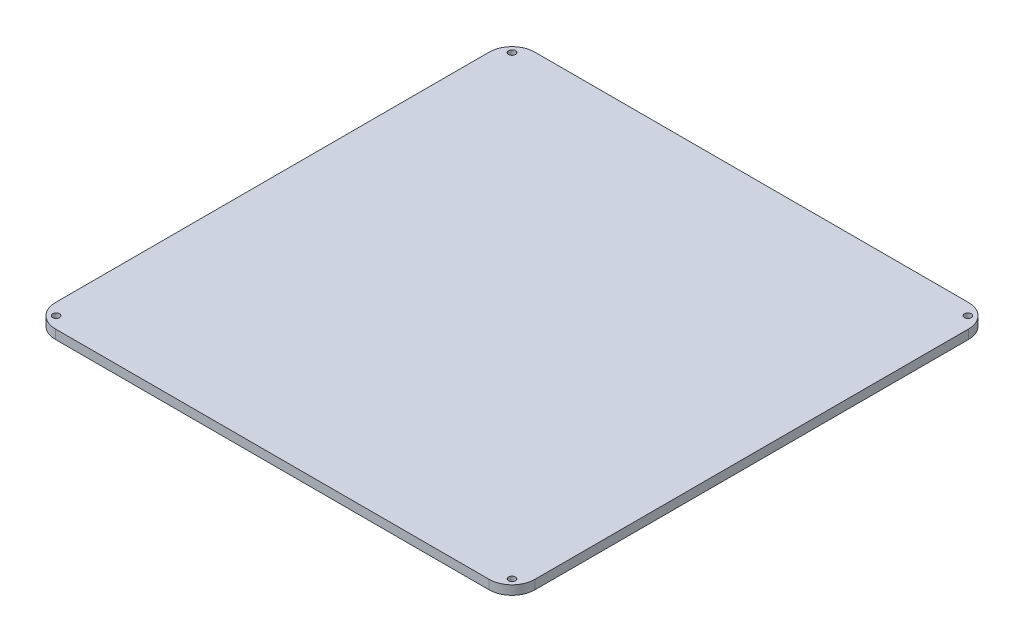
ISO-10303-21;
HEADER;
FILE_DESCRIPTION(('STEP AP214'),'2;1');
FILE_NAME('part.step','',(''),(''),'','','');
FILE_SCHEMA(('AUTOMOTIVE_DESIGN { 1 0 10303 214 1 1 1 1 }'));
ENDSEC;
DATA;
#1=APPLICATION_CONTEXT('core data for automotive mechanical design processes');
#2=APPLICATION_PROTOCOL_DEFINITION('international standard','automotive_design',2000,#1);
#3=PRODUCT_CONTEXT('',#1,'mechanical');
#4=PRODUCT('Part','Part','',(#3));
#5=PRODUCT_RELATED_PRODUCT_CATEGORY('part','',(#4));
#6=PRODUCT_DEFINITION_FORMATION('','',#4);
#7=PRODUCT_DEFINITION_CONTEXT('part definition',#1,'design');
#8=PRODUCT_DEFINITION('design','',#6,#7);
#9=PRODUCT_DEFINITION_SHAPE('','',#8);
#10=(LENGTH_UNIT() NAMED_UNIT(*) SI_UNIT(.MILLI.,.METRE.));
#11=(NAMED_UNIT(*) PLANE_ANGLE_UNIT() SI_UNIT($,.RADIAN.));
#12=(NAMED_UNIT(*) SI_UNIT($,.STERADIAN.) SOLID_ANGLE_UNIT());
#13=UNCERTAINTY_MEASURE_WITH_UNIT(LENGTH_MEASURE(1.E-05),#10,'distance_accuracy_value','');
#14=(GEOMETRIC_REPRESENTATION_CONTEXT(3) GLOBAL_UNCERTAINTY_ASSIGNED_CONTEXT((#13)) GLOBAL_UNIT_ASSIGNED_CONTEXT((#10,
#11,#12)) REPRESENTATION_CONTEXT('',''));
#15=CARTESIAN_POINT('',(0.,0.,0.));
#16=DIRECTION('',(0.,0.,1.));
#17=DIRECTION('',(1.,0.,0.));
#18=AXIS2_PLACEMENT_3D('',#15,#16,#17);
#19=CARTESIAN_POINT('',(0.,4.,0.));
#20=DIRECTION('',(0.,1.,0.));
#21=DIRECTION('',(0.,0.,1.));
#22=AXIS2_PLACEMENT_3D('',#19,#20,#21);
#23=PLANE('',#22);
#24=CARTESIAN_POINT('',(99.8332738110422,4.,99.8332738110422));
#25=DIRECTION('',(0.,1.,0.));
#26=DIRECTION('',(0.,0.,1.));
#27=AXIS2_PLACEMENT_3D('',#24,#25,#26);
#28=CIRCLE('',#27,1.5);
#29=CARTESIAN_POINT('',(99.8332738110422,4.,101.333273811042));
#30=VERTEX_POINT('',#29);
#31=EDGE_CURVE('E232',#30,#30,#28,.T.);
#32=ORIENTED_EDGE('',*,*,#31,.F.);
#33=EDGE_LOOP('',(#32));
#34=FACE_BOUND('',#33,.T.);
#35=CARTESIAN_POINT('',(-99.8332738110422,4.,-99.8332738110422));
#36=DIRECTION('',(0.,1.,0.));
#37=DIRECTION('',(0.,0.,1.));
#38=AXIS2_PLACEMENT_3D('',#35,#36,#37);
#39=CIRCLE('',#38,1.5);
#40=CARTESIAN_POINT('',(-99.8332738110422,4.,-98.3332738110422));
#41=VERTEX_POINT('',#40);
#42=EDGE_CURVE('E244',#41,#41,#39,.T.);
#43=ORIENTED_EDGE('',*,*,#42,.F.);
#44=EDGE_LOOP('',(#43));
#45=FACE_BOUND('',#44,.T.);
#46=DIRECTION('',(1.,0.,0.));
#47=VECTOR('',#46,1.);
#48=CARTESIAN_POINT('',(-105.,4.,-105.));
#49=LINE('',#48,#47);
#50=CARTESIAN_POINT('',(-95.,4.,-105.));
#51=VERTEX_POINT('',#50);
#52=CARTESIAN_POINT('',(95.,4.,-105.));
#53=VERTEX_POINT('',#52);
#54=EDGE_CURVE('E133',#51,#53,#49,.T.);
#55=ORIENTED_EDGE('',*,*,#54,.F.);
#56=CARTESIAN_POINT('',(-95.,4.,-95.));
#57=DIRECTION('',(0.,1.,0.));
#58=DIRECTION('',(0.,0.,1.));
#59=AXIS2_PLACEMENT_3D('',#56,#57,#58);
#60=CIRCLE('',#59,10.);
#61=CARTESIAN_POINT('',(-105.,4.,-95.));
#62=VERTEX_POINT('',#61);
#63=EDGE_CURVE('E158',#51,#62,#60,.T.);
#64=ORIENTED_EDGE('',*,*,#63,.T.);
#65=DIRECTION('',(0.,0.,-1.));
#66=VECTOR('',#65,1.);
#67=CARTESIAN_POINT('',(-105.,4.,105.));
#68=LINE('',#67,#66);
#69=CARTESIAN_POINT('',(-105.,4.,95.));
#70=VERTEX_POINT('',#69);
#71=EDGE_CURVE('E138',#70,#62,#68,.T.);
#72=ORIENTED_EDGE('',*,*,#71,.F.);
#73=CARTESIAN_POINT('',(-95.,4.,95.));
#74=DIRECTION('',(0.,1.,0.));
#75=DIRECTION('',(0.,0.,1.));
#76=AXIS2_PLACEMENT_3D('',#73,#74,#75);
#77=CIRCLE('',#76,10.);
#78=CARTESIAN_POINT('',(-95.,4.,105.));
#79=VERTEX_POINT('',#78);
#80=EDGE_CURVE('E137',#70,#79,#77,.T.);
#81=ORIENTED_EDGE('',*,*,#80,.T.);
#82=DIRECTION('',(1.,0.,0.));
#83=VECTOR('',#82,1.);
#84=CARTESIAN_POINT('',(-105.,4.,105.));
#85=LINE('',#84,#83);
#86=CARTESIAN_POINT('',(95.,4.,105.));
#87=VERTEX_POINT('',#86);
#88=EDGE_CURVE('E142',#79,#87,#85,.T.);
#89=ORIENTED_EDGE('',*,*,#88,.T.);
#90=CARTESIAN_POINT('',(95.,4.,95.));
#91=DIRECTION('',(0.,1.,0.));
#92=DIRECTION('',(0.,0.,1.));
#93=AXIS2_PLACEMENT_3D('',#90,#91,#92);
#94=CIRCLE('',#93,10.);
#95=CARTESIAN_POINT('',(105.,4.,95.));
#96=VERTEX_POINT('',#95);
#97=EDGE_CURVE('E66',#87,#96,#94,.T.);
#98=ORIENTED_EDGE('',*,*,#97,.T.);
#99=DIRECTION('',(0.,0.,-1.));
#100=VECTOR('',#99,1.);
#101=CARTESIAN_POINT('',(105.,4.,105.));
#102=LINE('',#101,#100);
#103=CARTESIAN_POINT('',(105.,4.,-95.));
#104=VERTEX_POINT('',#103);
#105=EDGE_CURVE('E250',#96,#104,#102,.T.);
#106=ORIENTED_EDGE('',*,*,#105,.T.);
#107=CARTESIAN_POINT('',(95.,4.,-95.));
#108=DIRECTION('',(0.,1.,0.));
#109=DIRECTION('',(0.,0.,1.));
#110=AXIS2_PLACEMENT_3D('',#107,#108,#109);
#111=CIRCLE('',#110,10.);
#112=EDGE_CURVE('E155',#104,#53,#111,.T.);
#113=ORIENTED_EDGE('',*,*,#112,.T.);
#114=EDGE_LOOP('',(#55,#64,#72,#81,#89,#98,#106,#113));
#115=FACE_BOUND('',#114,.T.);
#116=CARTESIAN_POINT('',(-99.8332738110422,4.,99.8332738110422));
#117=DIRECTION('',(0.,1.,0.));
#118=DIRECTION('',(0.,0.,1.));
#119=AXIS2_PLACEMENT_3D('',#116,#117,#118);
#120=CIRCLE('',#119,1.5);
#121=CARTESIAN_POINT('',(-99.8332738110422,4.,101.333273811042));
#122=VERTEX_POINT('',#121);
#123=EDGE_CURVE('E224',#122,#122,#120,.F.);
#124=ORIENTED_EDGE('',*,*,#123,.T.);
#125=EDGE_LOOP('',(#124));
#126=FACE_BOUND('',#125,.T.);
#127=CARTESIAN_POINT('',(99.8332738110422,4.,-99.8332738110422));
#128=DIRECTION('',(0.,1.,0.));
#129=DIRECTION('',(0.,0.,1.));
#130=AXIS2_PLACEMENT_3D('',#127,#128,#129);
#131=CIRCLE('',#130,1.5);
#132=CARTESIAN_POINT('',(99.8332738110422,4.,-98.3332738110422));
#133=VERTEX_POINT('',#132);
#134=EDGE_CURVE('E223',#133,#133,#131,.F.);
#135=ORIENTED_EDGE('',*,*,#134,.T.);
#136=EDGE_LOOP('',(#135));
#137=FACE_BOUND('',#136,.T.);
#138=ADVANCED_FACE('F44',(#34,#45,#115,#126,#137),#23,.T.);
#139=CARTESIAN_POINT('',(0.,0.,0.));
#140=DIRECTION('',(0.,1.,0.));
#141=DIRECTION('',(0.,0.,1.));
#142=AXIS2_PLACEMENT_3D('',#139,#140,#141);
#143=PLANE('',#142);
#144=CARTESIAN_POINT('',(-17.92,0.,-37.135));
#145=DIRECTION('',(0.,1.,0.));
#146=DIRECTION('',(0.,0.,1.));
#147=AXIS2_PLACEMENT_3D('',#144,#145,#146);
#148=CIRCLE('',#147,4.);
#149=CARTESIAN_POINT('',(-17.92,0.,-33.135));
#150=VERTEX_POINT('',#149);
#151=EDGE_CURVE('E11',#150,#150,#148,.T.);
#152=ORIENTED_EDGE('',*,*,#151,.T.);
#153=EDGE_LOOP('',(#152));
#154=FACE_BOUND('',#153,.T.);
#155=CARTESIAN_POINT('',(17.92,0.,-37.135));
#156=DIRECTION('',(0.,1.,0.));
#157=DIRECTION('',(0.,0.,1.));
#158=AXIS2_PLACEMENT_3D('',#155,#156,#157);
#159=CIRCLE('',#158,4.);
#160=CARTESIAN_POINT('',(17.92,0.,-33.135));
#161=VERTEX_POINT('',#160);
#162=EDGE_CURVE('E52',#161,#161,#159,.T.);
#163=ORIENTED_EDGE('',*,*,#162,.T.);
#164=EDGE_LOOP('',(#163));
#165=FACE_BOUND('',#164,.T.);
#166=CARTESIAN_POINT('',(17.92,0.,37.135));
#167=DIRECTION('',(0.,1.,0.));
#168=DIRECTION('',(0.,0.,1.));
#169=AXIS2_PLACEMENT_3D('',#166,#167,#168);
#170=CIRCLE('',#169,4.);
#171=CARTESIAN_POINT('',(17.92,0.,41.135));
#172=VERTEX_POINT('',#171);
#173=EDGE_CURVE('E171',#172,#172,#170,.T.);
#174=ORIENTED_EDGE('',*,*,#173,.T.);
#175=EDGE_LOOP('',(#174));
#176=FACE_BOUND('',#175,.T.);
#177=CARTESIAN_POINT('',(-17.92,0.,37.135));
#178=DIRECTION('',(0.,1.,0.));
#179=DIRECTION('',(0.,0.,1.));
#180=AXIS2_PLACEMENT_3D('',#177,#178,#179);
#181=CIRCLE('',#180,4.);
#182=CARTESIAN_POINT('',(-17.92,0.,41.135));
#183=VERTEX_POINT('',#182);
#184=EDGE_CURVE('E168',#183,#183,#181,.T.);
#185=ORIENTED_EDGE('',*,*,#184,.T.);
#186=EDGE_LOOP('',(#185));
#187=FACE_BOUND('',#186,.T.);
#188=CARTESIAN_POINT('',(-99.8332738110422,0.,99.8332738110422));
#189=DIRECTION('',(0.,-1.,0.));
#190=DIRECTION('',(0.,0.,-1.));
#191=AXIS2_PLACEMENT_3D('',#188,#189,#190);
#192=CIRCLE('',#191,1.5);
#193=CARTESIAN_POINT('',(-99.8332738110422,0.,98.3332738110422));
#194=VERTEX_POINT('',#193);
#195=EDGE_CURVE('E227',#194,#194,#192,.T.);
#196=ORIENTED_EDGE('',*,*,#195,.F.);
#197=EDGE_LOOP('',(#196));
#198=FACE_BOUND('',#197,.T.);
#199=CARTESIAN_POINT('',(-99.8332738110422,0.,-99.8332738110422));
#200=DIRECTION('',(0.,1.,0.));
#201=DIRECTION('',(0.,0.,1.));
#202=AXIS2_PLACEMENT_3D('',#199,#200,#201);
#203=CIRCLE('',#202,1.5);
#204=CARTESIAN_POINT('',(-99.8332738110422,0.,-98.3332738110422));
#205=VERTEX_POINT('',#204);
#206=EDGE_CURVE('E231',#205,#205,#203,.T.);
#207=ORIENTED_EDGE('',*,*,#206,.T.);
#208=EDGE_LOOP('',(#207));
#209=FACE_BOUND('',#208,.T.);
#210=DIRECTION('',(0.,0.,-1.));
#211=VECTOR('',#210,1.);
#212=CARTESIAN_POINT('',(-105.,0.,105.));
#213=LINE('',#212,#211);
#214=CARTESIAN_POINT('',(-105.,0.,95.));
#215=VERTEX_POINT('',#214);
#216=CARTESIAN_POINT('',(-105.,0.,-95.));
#217=VERTEX_POINT('',#216);
#218=EDGE_CURVE('E115',#215,#217,#213,.T.);
#219=ORIENTED_EDGE('',*,*,#218,.T.);
#220=CARTESIAN_POINT('',(-95.,0.,-95.));
#221=DIRECTION('',(0.,1.,0.));
#222=DIRECTION('',(0.,0.,1.));
#223=AXIS2_PLACEMENT_3D('',#220,#221,#222);
#224=CIRCLE('',#223,10.);
#225=CARTESIAN_POINT('',(-95.,0.,-105.));
#226=VERTEX_POINT('',#225);
#227=EDGE_CURVE('E122',#217,#226,#224,.F.);
#228=ORIENTED_EDGE('',*,*,#227,.T.);
#229=DIRECTION('',(1.,0.,0.));
#230=VECTOR('',#229,1.);
#231=CARTESIAN_POINT('',(-105.,0.,-105.));
#232=LINE('',#231,#230);
#233=CARTESIAN_POINT('',(95.,0.,-105.));
#234=VERTEX_POINT('',#233);
#235=EDGE_CURVE('E247',#226,#234,#232,.T.);
#236=ORIENTED_EDGE('',*,*,#235,.T.);
#237=CARTESIAN_POINT('',(95.,0.,-95.));
#238=DIRECTION('',(0.,1.,0.));
#239=DIRECTION('',(0.,0.,1.));
#240=AXIS2_PLACEMENT_3D('',#237,#238,#239);
#241=CIRCLE('',#240,10.);
#242=CARTESIAN_POINT('',(105.,0.,-95.));
#243=VERTEX_POINT('',#242);
#244=EDGE_CURVE('E123',#234,#243,#241,.F.);
#245=ORIENTED_EDGE('',*,*,#244,.T.);
#246=DIRECTION('',(0.,0.,-1.));
#247=VECTOR('',#246,1.);
#248=CARTESIAN_POINT('',(105.,0.,105.));
#249=LINE('',#248,#247);
#250=CARTESIAN_POINT('',(105.,0.,95.));
#251=VERTEX_POINT('',#250);
#252=EDGE_CURVE('E255',#251,#243,#249,.T.);
#253=ORIENTED_EDGE('',*,*,#252,.F.);
#254=CARTESIAN_POINT('',(95.,0.,95.));
#255=DIRECTION('',(0.,1.,0.));
#256=DIRECTION('',(0.,0.,1.));
#257=AXIS2_PLACEMENT_3D('',#254,#255,#256);
#258=CIRCLE('',#257,10.);
#259=CARTESIAN_POINT('',(95.,0.,105.));
#260=VERTEX_POINT('',#259);
#261=EDGE_CURVE('E140',#251,#260,#258,.F.);
#262=ORIENTED_EDGE('',*,*,#261,.T.);
#263=DIRECTION('',(1.,0.,0.));
#264=VECTOR('',#263,1.);
#265=CARTESIAN_POINT('',(-105.,0.,105.));
#266=LINE('',#265,#264);
#267=CARTESIAN_POINT('',(-95.,0.,105.));
#268=VERTEX_POINT('',#267);
#269=EDGE_CURVE('E117',#268,#260,#266,.T.);
#270=ORIENTED_EDGE('',*,*,#269,.F.);
#271=CARTESIAN_POINT('',(-95.,0.,95.));
#272=DIRECTION('',(0.,1.,0.));
#273=DIRECTION('',(0.,0.,1.));
#274=AXIS2_PLACEMENT_3D('',#271,#272,#273);
#275=CIRCLE('',#274,10.);
#276=EDGE_CURVE('E111',#268,#215,#275,.F.);
#277=ORIENTED_EDGE('',*,*,#276,.T.);
#278=EDGE_LOOP('',(#219,#228,#236,#245,#253,#262,#270,#277));
#279=FACE_BOUND('',#278,.T.);
#280=CARTESIAN_POINT('',(99.8332738110422,0.,99.8332738110422));
#281=DIRECTION('',(0.,1.,0.));
#282=DIRECTION('',(0.,0.,1.));
#283=AXIS2_PLACEMENT_3D('',#280,#281,#282);
#284=CIRCLE('',#283,1.5);
#285=CARTESIAN_POINT('',(99.8332738110422,0.,101.333273811042));
#286=VERTEX_POINT('',#285);
#287=EDGE_CURVE('E228',#286,#286,#284,.T.);
#288=ORIENTED_EDGE('',*,*,#287,.T.);
#289=EDGE_LOOP('',(#288));
#290=FACE_BOUND('',#289,.T.);
#291=CARTESIAN_POINT('',(99.8332738110422,0.,-99.8332738110422));
#292=DIRECTION('',(0.,-1.,0.));
#293=DIRECTION('',(0.,0.,-1.));
#294=AXIS2_PLACEMENT_3D('',#291,#292,#293);
#295=CIRCLE('',#294,1.5);
#296=CARTESIAN_POINT('',(99.8332738110422,0.,-101.333273811042));
#297=VERTEX_POINT('',#296);
#298=EDGE_CURVE('E235',#297,#297,#295,.T.);
#299=ORIENTED_EDGE('',*,*,#298,.F.);
#300=EDGE_LOOP('',(#299));
#301=FACE_BOUND('',#300,.T.);
#302=ADVANCED_FACE('F113',(#154,#165,#176,#187,#198,#209,#279,#290,#301),#143,.F.);
#303=CARTESIAN_POINT('',(-105.,4.,-105.));
#304=DIRECTION('',(0.,0.,-1.));
#305=DIRECTION('',(-1.,0.,0.));
#306=AXIS2_PLACEMENT_3D('',#303,#304,#305);
#307=PLANE('',#306);
#308=ORIENTED_EDGE('',*,*,#235,.F.);
#309=DIRECTION('',(0.,-1.,0.));
#310=VECTOR('',#309,1.);
#311=CARTESIAN_POINT('',(-95.,4.,-105.));
#312=LINE('',#311,#310);
#313=EDGE_CURVE('E152',#226,#51,#312,.F.);
#314=ORIENTED_EDGE('',*,*,#313,.T.);
#315=ORIENTED_EDGE('',*,*,#54,.T.);
#316=DIRECTION('',(0.,-1.,0.));
#317=VECTOR('',#316,1.);
#318=CARTESIAN_POINT('',(95.,0.,-105.));
#319=LINE('',#318,#317);
#320=EDGE_CURVE('E149',#53,#234,#319,.T.);
#321=ORIENTED_EDGE('',*,*,#320,.T.);
#322=EDGE_LOOP('',(#308,#314,#315,#321));
#323=FACE_BOUND('',#322,.T.);
#324=ADVANCED_FACE('F271',(#323),#307,.T.);
#325=CARTESIAN_POINT('',(-105.,4.,105.));
#326=DIRECTION('',(-1.,0.,0.));
#327=DIRECTION('',(0.,0.,1.));
#328=AXIS2_PLACEMENT_3D('',#325,#326,#327);
#329=PLANE('',#328);
#330=ORIENTED_EDGE('',*,*,#71,.T.);
#331=DIRECTION('',(0.,-1.,0.));
#332=VECTOR('',#331,1.);
#333=CARTESIAN_POINT('',(-105.,4.,-95.));
#334=LINE('',#333,#332);
#335=EDGE_CURVE('E132',#62,#217,#334,.T.);
#336=ORIENTED_EDGE('',*,*,#335,.T.);
#337=ORIENTED_EDGE('',*,*,#218,.F.);
#338=DIRECTION('',(0.,-1.,0.));
#339=VECTOR('',#338,1.);
#340=CARTESIAN_POINT('',(-105.,4.,95.));
#341=LINE('',#340,#339);
#342=EDGE_CURVE('E129',#215,#70,#341,.F.);
#343=ORIENTED_EDGE('',*,*,#342,.T.);
#344=EDGE_LOOP('',(#330,#336,#337,#343));
#345=FACE_BOUND('',#344,.T.);
#346=ADVANCED_FACE('F128',(#345),#329,.T.);
#347=CARTESIAN_POINT('',(-105.,4.,105.));
#348=DIRECTION('',(0.,0.,-1.));
#349=DIRECTION('',(-1.,0.,0.));
#350=AXIS2_PLACEMENT_3D('',#347,#348,#349);
#351=PLANE('',#350);
#352=ORIENTED_EDGE('',*,*,#88,.F.);
#353=DIRECTION('',(0.,-1.,0.));
#354=VECTOR('',#353,1.);
#355=CARTESIAN_POINT('',(-95.,0.,105.));
#356=LINE('',#355,#354);
#357=EDGE_CURVE('E162',#79,#268,#356,.T.);
#358=ORIENTED_EDGE('',*,*,#357,.T.);
#359=ORIENTED_EDGE('',*,*,#269,.T.);
#360=DIRECTION('',(0.,-1.,0.));
#361=VECTOR('',#360,1.);
#362=CARTESIAN_POINT('',(95.,4.,105.));
#363=LINE('',#362,#361);
#364=EDGE_CURVE('E160',#260,#87,#363,.F.);
#365=ORIENTED_EDGE('',*,*,#364,.T.);
#366=EDGE_LOOP('',(#352,#358,#359,#365));
#367=FACE_BOUND('',#366,.T.);
#368=ADVANCED_FACE('F259',(#367),#351,.F.);
#369=CARTESIAN_POINT('',(105.,4.,105.));
#370=DIRECTION('',(-1.,0.,0.));
#371=DIRECTION('',(0.,0.,1.));
#372=AXIS2_PLACEMENT_3D('',#369,#370,#371);
#373=PLANE('',#372);
#374=ORIENTED_EDGE('',*,*,#252,.T.);
#375=DIRECTION('',(0.,-1.,0.));
#376=VECTOR('',#375,1.);
#377=CARTESIAN_POINT('',(105.,4.,-95.));
#378=LINE('',#377,#376);
#379=EDGE_CURVE('E59',#243,#104,#378,.F.);
#380=ORIENTED_EDGE('',*,*,#379,.T.);
#381=ORIENTED_EDGE('',*,*,#105,.F.);
#382=DIRECTION('',(0.,-1.,0.));
#383=VECTOR('',#382,1.);
#384=CARTESIAN_POINT('',(105.,4.,95.));
#385=LINE('',#384,#383);
#386=EDGE_CURVE('E164',#96,#251,#385,.T.);
#387=ORIENTED_EDGE('',*,*,#386,.T.);
#388=EDGE_LOOP('',(#374,#380,#381,#387));
#389=FACE_BOUND('',#388,.T.);
#390=ADVANCED_FACE('F264',(#389),#373,.F.);
#391=CARTESIAN_POINT('',(-99.8332738110422,8.24264068711929,-99.8332738110422));
#392=DIRECTION('',(0.,-1.,0.));
#393=DIRECTION('',(0.,0.,-1.));
#394=AXIS2_PLACEMENT_3D('',#391,#392,#393);
#395=CYLINDRICAL_SURFACE('',#394,1.5);
#396=ORIENTED_EDGE('',*,*,#206,.F.);
#397=EDGE_LOOP('',(#396));
#398=FACE_BOUND('',#397,.T.);
#399=ORIENTED_EDGE('',*,*,#42,.T.);
#400=EDGE_LOOP('',(#399));
#401=FACE_BOUND('',#400,.T.);
#402=ADVANCED_FACE('F305',(#398,#401),#395,.F.);
#403=CARTESIAN_POINT('',(-99.8332738110422,8.24264068711929,99.8332738110422));
#404=DIRECTION('',(0.,-1.,0.));
#405=DIRECTION('',(0.,0.,-1.));
#406=AXIS2_PLACEMENT_3D('',#403,#404,#405);
#407=CYLINDRICAL_SURFACE('',#406,1.5);
#408=ORIENTED_EDGE('',*,*,#195,.T.);
#409=EDGE_LOOP('',(#408));
#410=FACE_BOUND('',#409,.T.);
#411=ORIENTED_EDGE('',*,*,#123,.F.);
#412=EDGE_LOOP('',(#411));
#413=FACE_BOUND('',#412,.T.);
#414=ADVANCED_FACE('F350',(#410,#413),#407,.F.);
#415=CARTESIAN_POINT('',(99.8332738110422,8.24264068711929,99.8332738110422));
#416=DIRECTION('',(0.,-1.,0.));
#417=DIRECTION('',(0.,0.,-1.));
#418=AXIS2_PLACEMENT_3D('',#415,#416,#417);
#419=CYLINDRICAL_SURFACE('',#418,1.5);
#420=ORIENTED_EDGE('',*,*,#287,.F.);
#421=EDGE_LOOP('',(#420));
#422=FACE_BOUND('',#421,.T.);
#423=ORIENTED_EDGE('',*,*,#31,.T.);
#424=EDGE_LOOP('',(#423));
#425=FACE_BOUND('',#424,.T.);
#426=ADVANCED_FACE('F287',(#422,#425),#419,.F.);
#427=CARTESIAN_POINT('',(99.8332738110422,8.24264068711929,-99.8332738110422));
#428=DIRECTION('',(0.,-1.,0.));
#429=DIRECTION('',(0.,0.,-1.));
#430=AXIS2_PLACEMENT_3D('',#427,#428,#429);
#431=CYLINDRICAL_SURFACE('',#430,1.5);
#432=ORIENTED_EDGE('',*,*,#298,.T.);
#433=EDGE_LOOP('',(#432));
#434=FACE_BOUND('',#433,.T.);
#435=ORIENTED_EDGE('',*,*,#134,.F.);
#436=EDGE_LOOP('',(#435));
#437=FACE_BOUND('',#436,.T.);
#438=ADVANCED_FACE('F279',(#434,#437),#431,.F.);
#439=CARTESIAN_POINT('',(-95.,4.,-95.));
#440=DIRECTION('',(0.,-1.,0.));
#441=DIRECTION('',(0.,0.,-1.));
#442=AXIS2_PLACEMENT_3D('',#439,#440,#441);
#443=CYLINDRICAL_SURFACE('',#442,10.);
#444=ORIENTED_EDGE('',*,*,#63,.F.);
#445=ORIENTED_EDGE('',*,*,#313,.F.);
#446=ORIENTED_EDGE('',*,*,#227,.F.);
#447=ORIENTED_EDGE('',*,*,#335,.F.);
#448=EDGE_LOOP('',(#444,#445,#446,#447));
#449=FACE_BOUND('',#448,.T.);
#450=ADVANCED_FACE('F277',(#449),#443,.T.);
#451=CARTESIAN_POINT('',(-95.,4.,95.));
#452=DIRECTION('',(0.,1.,0.));
#453=DIRECTION('',(0.,0.,1.));
#454=AXIS2_PLACEMENT_3D('',#451,#452,#453);
#455=CYLINDRICAL_SURFACE('',#454,10.);
#456=ORIENTED_EDGE('',*,*,#80,.F.);
#457=ORIENTED_EDGE('',*,*,#342,.F.);
#458=ORIENTED_EDGE('',*,*,#276,.F.);
#459=ORIENTED_EDGE('',*,*,#357,.F.);
#460=EDGE_LOOP('',(#456,#457,#458,#459));
#461=FACE_BOUND('',#460,.T.);
#462=ADVANCED_FACE('F136',(#461),#455,.T.);
#463=CARTESIAN_POINT('',(95.,4.,-95.));
#464=DIRECTION('',(0.,1.,0.));
#465=DIRECTION('',(0.,0.,1.));
#466=AXIS2_PLACEMENT_3D('',#463,#464,#465);
#467=CYLINDRICAL_SURFACE('',#466,10.);
#468=ORIENTED_EDGE('',*,*,#112,.F.);
#469=ORIENTED_EDGE('',*,*,#379,.F.);
#470=ORIENTED_EDGE('',*,*,#244,.F.);
#471=ORIENTED_EDGE('',*,*,#320,.F.);
#472=EDGE_LOOP('',(#468,#469,#470,#471));
#473=FACE_BOUND('',#472,.T.);
#474=ADVANCED_FACE('F269',(#473),#467,.T.);
#475=CARTESIAN_POINT('',(95.,4.,95.));
#476=DIRECTION('',(0.,-1.,0.));
#477=DIRECTION('',(0.,0.,-1.));
#478=AXIS2_PLACEMENT_3D('',#475,#476,#477);
#479=CYLINDRICAL_SURFACE('',#478,10.);
#480=ORIENTED_EDGE('',*,*,#97,.F.);
#481=ORIENTED_EDGE('',*,*,#364,.F.);
#482=ORIENTED_EDGE('',*,*,#261,.F.);
#483=ORIENTED_EDGE('',*,*,#386,.F.);
#484=EDGE_LOOP('',(#480,#481,#482,#483));
#485=FACE_BOUND('',#484,.T.);
#486=ADVANCED_FACE('F261',(#485),#479,.T.);
#487=CARTESIAN_POINT('',(-17.92,-2.,37.135));
#488=DIRECTION('',(0.,-1.,0.));
#489=DIRECTION('',(0.,0.,-1.));
#490=AXIS2_PLACEMENT_3D('',#487,#488,#489);
#491=PLANE('',#490);
#492=CARTESIAN_POINT('',(-17.92,-2.,37.135));
#493=DIRECTION('',(0.,-1.,0.));
#494=DIRECTION('',(0.,0.,-1.));
#495=AXIS2_PLACEMENT_3D('',#492,#493,#494);
#496=CIRCLE('',#495,2.);
#497=CARTESIAN_POINT('',(-17.92,-2.,35.135));
#498=VERTEX_POINT('',#497);
#499=EDGE_CURVE('E218',#498,#498,#496,.T.);
#500=ORIENTED_EDGE('',*,*,#499,.T.);
#501=EDGE_LOOP('',(#500));
#502=FACE_BOUND('',#501,.T.);
#503=CARTESIAN_POINT('',(-17.92,-2.,37.135));
#504=DIRECTION('',(0.,-1.,0.));
#505=DIRECTION('',(0.,0.,-1.));
#506=AXIS2_PLACEMENT_3D('',#503,#504,#505);
#507=CIRCLE('',#506,0.97999999999999);
#508=CARTESIAN_POINT('',(-17.92,-2.,36.155));
#509=VERTEX_POINT('',#508);
#510=EDGE_CURVE('E215',#509,#509,#507,.T.);
#511=ORIENTED_EDGE('',*,*,#510,.F.);
#512=EDGE_LOOP('',(#511));
#513=FACE_BOUND('',#512,.T.);
#514=ADVANCED_FACE('F401',(#502,#513),#491,.T.);
#515=CARTESIAN_POINT('',(-17.92,-2.,37.135));
#516=DIRECTION('',(0.,1.,0.));
#517=DIRECTION('',(0.,0.,1.));
#518=AXIS2_PLACEMENT_3D('',#515,#516,#517);
#519=CYLINDRICAL_SURFACE('',#518,0.97999999999999);
#520=ORIENTED_EDGE('',*,*,#510,.T.);
#521=EDGE_LOOP('',(#520));
#522=FACE_BOUND('',#521,.T.);
#523=CARTESIAN_POINT('',(-17.92,0.,37.135));
#524=DIRECTION('',(0.,-1.,0.));
#525=DIRECTION('',(0.,0.,-1.));
#526=AXIS2_PLACEMENT_3D('',#523,#524,#525);
#527=CIRCLE('',#526,0.97999999999999);
#528=CARTESIAN_POINT('',(-17.92,0.,36.155));
#529=VERTEX_POINT('',#528);
#530=EDGE_CURVE('E212',#529,#529,#527,.T.);
#531=ORIENTED_EDGE('',*,*,#530,.F.);
#532=EDGE_LOOP('',(#531));
#533=FACE_BOUND('',#532,.T.);
#534=ADVANCED_FACE('F412',(#522,#533),#519,.F.);
#535=ORIENTED_EDGE('',*,*,#530,.T.);
#536=EDGE_LOOP('',(#535));
#537=FACE_BOUND('',#536,.T.);
#538=ADVANCED_FACE('F301',(#537),#143,.F.);
#539=CARTESIAN_POINT('',(17.92,-2.,37.135));
#540=DIRECTION('',(0.,-1.,0.));
#541=DIRECTION('',(0.,0.,-1.));
#542=AXIS2_PLACEMENT_3D('',#539,#540,#541);
#543=PLANE('',#542);
#544=CARTESIAN_POINT('',(17.92,-2.,37.135));
#545=DIRECTION('',(0.,-1.,0.));
#546=DIRECTION('',(0.,0.,-1.));
#547=AXIS2_PLACEMENT_3D('',#544,#545,#546);
#548=CIRCLE('',#547,2.);
#549=CARTESIAN_POINT('',(17.92,-2.,35.135));
#550=VERTEX_POINT('',#549);
#551=EDGE_CURVE('E203',#550,#550,#548,.T.);
#552=ORIENTED_EDGE('',*,*,#551,.T.);
#553=EDGE_LOOP('',(#552));
#554=FACE_BOUND('',#553,.T.);
#555=CARTESIAN_POINT('',(17.92,-2.,37.135));
#556=DIRECTION('',(0.,-1.,0.));
#557=DIRECTION('',(0.,0.,-1.));
#558=AXIS2_PLACEMENT_3D('',#555,#556,#557);
#559=CIRCLE('',#558,0.97999999999999);
#560=CARTESIAN_POINT('',(17.92,-2.,36.155));
#561=VERTEX_POINT('',#560);
#562=EDGE_CURVE('E208',#561,#561,#559,.T.);
#563=ORIENTED_EDGE('',*,*,#562,.F.);
#564=EDGE_LOOP('',(#563));
#565=FACE_BOUND('',#564,.T.);
#566=ADVANCED_FACE('F411',(#554,#565),#543,.T.);
#567=CARTESIAN_POINT('',(17.92,-2.,37.135));
#568=DIRECTION('',(0.,1.,0.));
#569=DIRECTION('',(0.,0.,1.));
#570=AXIS2_PLACEMENT_3D('',#567,#568,#569);
#571=CYLINDRICAL_SURFACE('',#570,0.97999999999999);
#572=ORIENTED_EDGE('',*,*,#562,.T.);
#573=EDGE_LOOP('',(#572));
#574=FACE_BOUND('',#573,.T.);
#575=CARTESIAN_POINT('',(17.92,0.,37.135));
#576=DIRECTION('',(0.,-1.,0.));
#577=DIRECTION('',(0.,0.,-1.));
#578=AXIS2_PLACEMENT_3D('',#575,#576,#577);
#579=CIRCLE('',#578,0.97999999999999);
#580=CARTESIAN_POINT('',(17.92,0.,36.155));
#581=VERTEX_POINT('',#580);
#582=EDGE_CURVE('E209',#581,#581,#579,.T.);
#583=ORIENTED_EDGE('',*,*,#582,.F.);
#584=EDGE_LOOP('',(#583));
#585=FACE_BOUND('',#584,.T.);
#586=ADVANCED_FACE('F422',(#574,#585),#571,.F.);
#587=ORIENTED_EDGE('',*,*,#582,.T.);
#588=EDGE_LOOP('',(#587));
#589=FACE_BOUND('',#588,.T.);
#590=ADVANCED_FACE('F414',(#589),#143,.F.);
#591=CARTESIAN_POINT('',(-17.92,-2.,-37.135));
#592=DIRECTION('',(0.,1.,0.));
#593=DIRECTION('',(0.,0.,1.));
#594=AXIS2_PLACEMENT_3D('',#591,#592,#593);
#595=PLANE('',#594);
#596=CARTESIAN_POINT('',(-17.92,-2.,-37.135));
#597=DIRECTION('',(0.,-1.,0.));
#598=DIRECTION('',(0.,0.,1.));
#599=AXIS2_PLACEMENT_3D('',#596,#597,#598);
#600=CIRCLE('',#599,2.);
#601=CARTESIAN_POINT('',(-17.92,-2.,-35.135));
#602=VERTEX_POINT('',#601);
#603=EDGE_CURVE('E195',#602,#602,#600,.T.);
#604=ORIENTED_EDGE('',*,*,#603,.T.);
#605=EDGE_LOOP('',(#604));
#606=FACE_BOUND('',#605,.T.);
#607=CARTESIAN_POINT('',(-17.92,-2.,-37.135));
#608=DIRECTION('',(0.,-1.,0.));
#609=DIRECTION('',(0.,0.,1.));
#610=AXIS2_PLACEMENT_3D('',#607,#608,#609);
#611=CIRCLE('',#610,0.97999999999999);
#612=CARTESIAN_POINT('',(-17.92,-2.,-36.155));
#613=VERTEX_POINT('',#612);
#614=EDGE_CURVE('E199',#613,#613,#611,.T.);
#615=ORIENTED_EDGE('',*,*,#614,.F.);
#616=EDGE_LOOP('',(#615));
#617=FACE_BOUND('',#616,.T.);
#618=ADVANCED_FACE('F421',(#606,#617),#595,.F.);
#619=CARTESIAN_POINT('',(-17.92,-2.,-37.135));
#620=DIRECTION('',(0.,1.,0.));
#621=DIRECTION('',(0.,0.,1.));
#622=AXIS2_PLACEMENT_3D('',#619,#620,#621);
#623=CYLINDRICAL_SURFACE('',#622,0.97999999999999);
#624=ORIENTED_EDGE('',*,*,#614,.T.);
#625=EDGE_LOOP('',(#624));
#626=FACE_BOUND('',#625,.T.);
#627=CARTESIAN_POINT('',(-17.92,0.,-37.135));
#628=DIRECTION('',(0.,-1.,0.));
#629=DIRECTION('',(0.,0.,1.));
#630=AXIS2_PLACEMENT_3D('',#627,#628,#629);
#631=CIRCLE('',#630,0.97999999999999);
#632=CARTESIAN_POINT('',(-17.92,0.,-36.155));
#633=VERTEX_POINT('',#632);
#634=EDGE_CURVE('E200',#633,#633,#631,.T.);
#635=ORIENTED_EDGE('',*,*,#634,.F.);
#636=EDGE_LOOP('',(#635));
#637=FACE_BOUND('',#636,.T.);
#638=ADVANCED_FACE('F432',(#626,#637),#623,.F.);
#639=ORIENTED_EDGE('',*,*,#634,.T.);
#640=EDGE_LOOP('',(#639));
#641=FACE_BOUND('',#640,.T.);
#642=ADVANCED_FACE('F424',(#641),#143,.F.);
#643=CARTESIAN_POINT('',(17.92,-2.,-37.135));
#644=DIRECTION('',(0.,1.,0.));
#645=DIRECTION('',(0.,0.,1.));
#646=AXIS2_PLACEMENT_3D('',#643,#644,#645);
#647=PLANE('',#646);
#648=CARTESIAN_POINT('',(17.92,-2.,-37.135));
#649=DIRECTION('',(0.,-1.,0.));
#650=DIRECTION('',(0.,0.,1.));
#651=AXIS2_PLACEMENT_3D('',#648,#649,#650);
#652=CIRCLE('',#651,2.);
#653=CARTESIAN_POINT('',(17.92,-2.,-35.135));
#654=VERTEX_POINT('',#653);
#655=EDGE_CURVE('E186',#654,#654,#652,.T.);
#656=ORIENTED_EDGE('',*,*,#655,.T.);
#657=EDGE_LOOP('',(#656));
#658=FACE_BOUND('',#657,.T.);
#659=CARTESIAN_POINT('',(17.92,-2.,-37.135));
#660=DIRECTION('',(0.,-1.,0.));
#661=DIRECTION('',(0.,0.,1.));
#662=AXIS2_PLACEMENT_3D('',#659,#660,#661);
#663=CIRCLE('',#662,0.97999999999999);
#664=CARTESIAN_POINT('',(17.92,-2.,-36.155));
#665=VERTEX_POINT('',#664);
#666=EDGE_CURVE('E188',#665,#665,#663,.T.);
#667=ORIENTED_EDGE('',*,*,#666,.F.);
#668=EDGE_LOOP('',(#667));
#669=FACE_BOUND('',#668,.T.);
#670=ADVANCED_FACE('F431',(#658,#669),#647,.F.);
#671=CARTESIAN_POINT('',(17.92,-2.,-37.135));
#672=DIRECTION('',(0.,1.,0.));
#673=DIRECTION('',(0.,0.,1.));
#674=AXIS2_PLACEMENT_3D('',#671,#672,#673);
#675=CYLINDRICAL_SURFACE('',#674,0.97999999999999);
#676=ORIENTED_EDGE('',*,*,#666,.T.);
#677=EDGE_LOOP('',(#676));
#678=FACE_BOUND('',#677,.T.);
#679=CARTESIAN_POINT('',(17.92,0.,-37.135));
#680=DIRECTION('',(0.,-1.,0.));
#681=DIRECTION('',(0.,0.,1.));
#682=AXIS2_PLACEMENT_3D('',#679,#680,#681);
#683=CIRCLE('',#682,0.97999999999999);
#684=CARTESIAN_POINT('',(17.92,0.,-36.155));
#685=VERTEX_POINT('',#684);
#686=EDGE_CURVE('E191',#685,#685,#683,.T.);
#687=ORIENTED_EDGE('',*,*,#686,.F.);
#688=EDGE_LOOP('',(#687));
#689=FACE_BOUND('',#688,.T.);
#690=ADVANCED_FACE('F439',(#678,#689),#675,.F.);
#691=ORIENTED_EDGE('',*,*,#686,.T.);
#692=EDGE_LOOP('',(#691));
#693=FACE_BOUND('',#692,.T.);
#694=ADVANCED_FACE('F300',(#693),#143,.F.);
#695=CARTESIAN_POINT('',(-17.92,-2.,-37.135));
#696=DIRECTION('',(0.,1.,0.));
#697=DIRECTION('',(0.,0.,1.));
#698=AXIS2_PLACEMENT_3D('',#695,#696,#697);
#699=TOROIDAL_SURFACE('',#698,4.,2.);
#700=ORIENTED_EDGE('',*,*,#151,.F.);
#701=EDGE_LOOP('',(#700));
#702=FACE_BOUND('',#701,.T.);
#703=ORIENTED_EDGE('',*,*,#603,.F.);
#704=EDGE_LOOP('',(#703));
#705=FACE_BOUND('',#704,.T.);
#706=ADVANCED_FACE('F182',(#702,#705),#699,.F.);
#707=CARTESIAN_POINT('',(17.92,-2.,-37.135));
#708=DIRECTION('',(0.,1.,0.));
#709=DIRECTION('',(0.,0.,1.));
#710=AXIS2_PLACEMENT_3D('',#707,#708,#709);
#711=TOROIDAL_SURFACE('',#710,4.,2.);
#712=ORIENTED_EDGE('',*,*,#162,.F.);
#713=EDGE_LOOP('',(#712));
#714=FACE_BOUND('',#713,.T.);
#715=ORIENTED_EDGE('',*,*,#655,.F.);
#716=EDGE_LOOP('',(#715));
#717=FACE_BOUND('',#716,.T.);
#718=ADVANCED_FACE('F178',(#714,#717),#711,.F.);
#719=CARTESIAN_POINT('',(17.92,-2.,37.135));
#720=DIRECTION('',(0.,1.,0.));
#721=DIRECTION('',(0.,0.,1.));
#722=AXIS2_PLACEMENT_3D('',#719,#720,#721);
#723=TOROIDAL_SURFACE('',#722,4.,2.);
#724=ORIENTED_EDGE('',*,*,#173,.F.);
#725=EDGE_LOOP('',(#724));
#726=FACE_BOUND('',#725,.T.);
#727=ORIENTED_EDGE('',*,*,#551,.F.);
#728=EDGE_LOOP('',(#727));
#729=FACE_BOUND('',#728,.T.);
#730=ADVANCED_FACE('F181',(#726,#729),#723,.F.);
#731=CARTESIAN_POINT('',(-17.92,-2.,37.135));
#732=DIRECTION('',(0.,1.,0.));
#733=DIRECTION('',(0.,0.,1.));
#734=AXIS2_PLACEMENT_3D('',#731,#732,#733);
#735=TOROIDAL_SURFACE('',#734,4.,2.);
#736=ORIENTED_EDGE('',*,*,#184,.F.);
#737=EDGE_LOOP('',(#736));
#738=FACE_BOUND('',#737,.T.);
#739=ORIENTED_EDGE('',*,*,#499,.F.);
#740=EDGE_LOOP('',(#739));
#741=FACE_BOUND('',#740,.T.);
#742=ADVANCED_FACE('F46',(#738,#741),#735,.F.);
#743=CLOSED_SHELL('',(#138,#302,#324,#346,#368,#390,#402,#414,#426,#438,#450,#462,#474,#486,
#514,#534,#538,#566,#586,#590,#618,#638,#642,#670,#690,#694,#706,#718,#730,#742));
#744=MANIFOLD_SOLID_BREP('B2',#743);
#745=ADVANCED_BREP_SHAPE_REPRESENTATION('',(#18,#744),#14);
#746=SHAPE_DEFINITION_REPRESENTATION(#9,#745);
ENDSEC;
END-ISO-10303-21;
